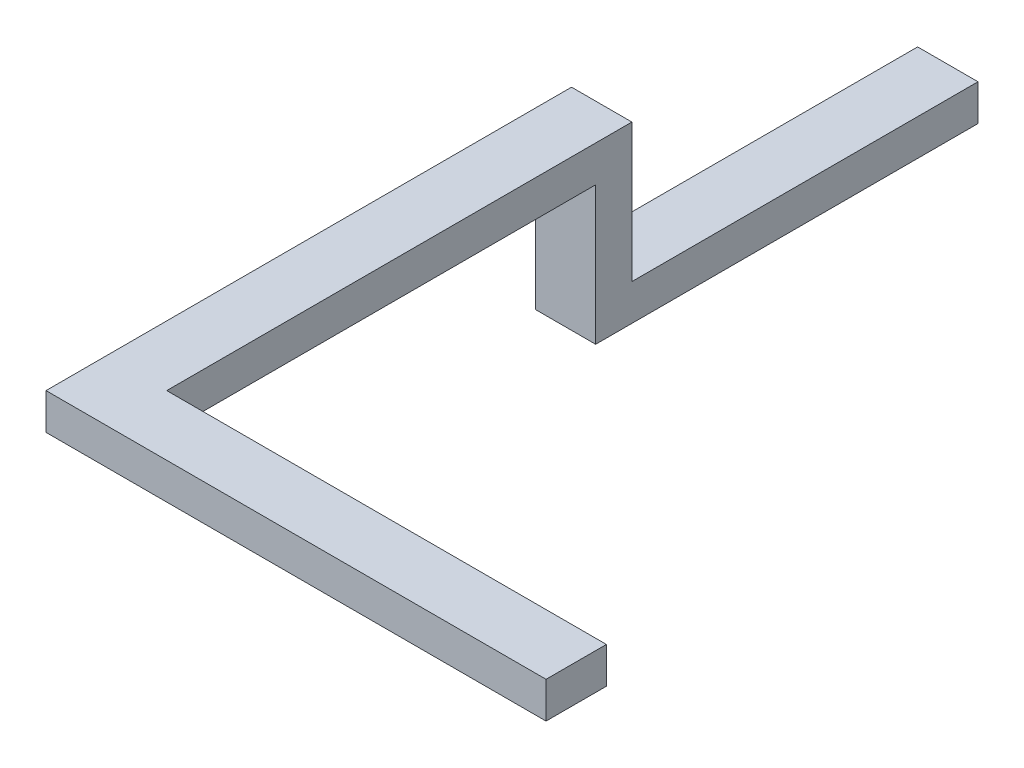
ISO-10303-21;
HEADER;
FILE_DESCRIPTION(('STEP AP214'),'2;1');
FILE_NAME('part.step','',(''),(''),'','','');
FILE_SCHEMA(('AUTOMOTIVE_DESIGN { 1 0 10303 214 1 1 1 1 }'));
ENDSEC;
DATA;
#1=APPLICATION_CONTEXT('core data for automotive mechanical design processes');
#2=APPLICATION_PROTOCOL_DEFINITION('international standard','automotive_design',2000,#1);
#3=PRODUCT_CONTEXT('',#1,'mechanical');
#4=PRODUCT('Part','Part','',(#3));
#5=PRODUCT_RELATED_PRODUCT_CATEGORY('part','',(#4));
#6=PRODUCT_DEFINITION_FORMATION('','',#4);
#7=PRODUCT_DEFINITION_CONTEXT('part definition',#1,'design');
#8=PRODUCT_DEFINITION('design','',#6,#7);
#9=PRODUCT_DEFINITION_SHAPE('','',#8);
#10=(LENGTH_UNIT() NAMED_UNIT(*) SI_UNIT(.MILLI.,.METRE.));
#11=(NAMED_UNIT(*) PLANE_ANGLE_UNIT() SI_UNIT($,.RADIAN.));
#12=(NAMED_UNIT(*) SI_UNIT($,.STERADIAN.) SOLID_ANGLE_UNIT());
#13=UNCERTAINTY_MEASURE_WITH_UNIT(LENGTH_MEASURE(1.E-05),#10,'distance_accuracy_value','');
#14=(GEOMETRIC_REPRESENTATION_CONTEXT(3) GLOBAL_UNCERTAINTY_ASSIGNED_CONTEXT((#13)) GLOBAL_UNIT_ASSIGNED_CONTEXT((#10,
#11,#12)) REPRESENTATION_CONTEXT('',''));
#15=CARTESIAN_POINT('',(0.,0.,0.));
#16=DIRECTION('',(0.,0.,1.));
#17=DIRECTION('',(1.,0.,0.));
#18=AXIS2_PLACEMENT_3D('',#15,#16,#17);
#19=CARTESIAN_POINT('',(0.,539.999999999999,6479.57134107215));
#20=DIRECTION('',(-1.,0.,0.));
#21=DIRECTION('',(0.,-1.,0.));
#22=AXIS2_PLACEMENT_3D('',#19,#20,#21);
#23=PLANE('',#22);
#24=DIRECTION('',(0.,1.,0.));
#25=VECTOR('',#24,1.);
#26=CARTESIAN_POINT('',(0.,2060.,12095.));
#27=LINE('',#26,#25);
#28=CARTESIAN_POINT('',(0.,2060.,12095.));
#29=VERTEX_POINT('',#28);
#30=CARTESIAN_POINT('',(0.,2600.,12095.));
#31=VERTEX_POINT('',#30);
#32=EDGE_CURVE('E51',#29,#31,#27,.T.);
#33=ORIENTED_EDGE('',*,*,#32,.F.);
#34=DIRECTION('',(0.,0.,1.));
#35=VECTOR('',#34,1.);
#36=CARTESIAN_POINT('',(0.,2060.,5700.));
#37=LINE('',#36,#35);
#38=CARTESIAN_POINT('',(0.,2060.,5700.));
#39=VERTEX_POINT('',#38);
#40=EDGE_CURVE('E139',#39,#29,#37,.T.);
#41=ORIENTED_EDGE('',*,*,#40,.F.);
#42=DIRECTION('',(0.,1.,0.));
#43=VECTOR('',#42,1.);
#44=CARTESIAN_POINT('',(0.,-6.99256490647889E-13,5700.));
#45=LINE('',#44,#43);
#46=CARTESIAN_POINT('',(0.,-6.99256490647889E-13,5700.));
#47=VERTEX_POINT('',#46);
#48=EDGE_CURVE('E177',#47,#39,#45,.T.);
#49=ORIENTED_EDGE('',*,*,#48,.F.);
#50=DIRECTION('',(0.,0.,-1.));
#51=VECTOR('',#50,1.);
#52=CARTESIAN_POINT('',(0.,-7.94891634536973E-13,6479.57134107215));
#53=LINE('',#52,#51);
#54=CARTESIAN_POINT('',(0.,0.,0.));
#55=VERTEX_POINT('',#54);
#56=EDGE_CURVE('E169',#47,#55,#53,.T.);
#57=ORIENTED_EDGE('',*,*,#56,.T.);
#58=DIRECTION('',(0.,1.,0.));
#59=VECTOR('',#58,1.);
#60=CARTESIAN_POINT('',(0.,540.,0.));
#61=LINE('',#60,#59);
#62=CARTESIAN_POINT('',(0.,540.,0.));
#63=VERTEX_POINT('',#62);
#64=EDGE_CURVE('E154',#55,#63,#61,.T.);
#65=ORIENTED_EDGE('',*,*,#64,.T.);
#66=DIRECTION('',(0.,0.,-1.));
#67=VECTOR('',#66,1.);
#68=CARTESIAN_POINT('',(0.,539.999999999999,6479.57134107215));
#69=LINE('',#68,#67);
#70=CARTESIAN_POINT('',(0.,540.,5160.));
#71=VERTEX_POINT('',#70);
#72=EDGE_CURVE('E167',#71,#63,#69,.T.);
#73=ORIENTED_EDGE('',*,*,#72,.F.);
#74=DIRECTION('',(0.,1.,0.));
#75=VECTOR('',#74,1.);
#76=CARTESIAN_POINT('',(0.,540.,5160.));
#77=LINE('',#76,#75);
#78=CARTESIAN_POINT('',(0.,2600.,5160.));
#79=VERTEX_POINT('',#78);
#80=EDGE_CURVE('E174',#71,#79,#77,.T.);
#81=ORIENTED_EDGE('',*,*,#80,.T.);
#82=DIRECTION('',(0.,0.,1.));
#83=VECTOR('',#82,1.);
#84=CARTESIAN_POINT('',(0.,2600.,5160.));
#85=LINE('',#84,#83);
#86=EDGE_CURVE('E190',#79,#31,#85,.T.);
#87=ORIENTED_EDGE('',*,*,#86,.T.);
#88=EDGE_LOOP('',(#33,#41,#49,#57,#65,#73,#81,#87));
#89=FACE_BOUND('',#88,.T.);
#90=ADVANCED_FACE('F34',(#89),#23,.F.);
#91=CARTESIAN_POINT('',(-900.000000000001,2600.,5160.));
#92=DIRECTION('',(0.,-1.,0.));
#93=DIRECTION('',(1.,0.,0.));
#94=AXIS2_PLACEMENT_3D('',#91,#92,#93);
#95=PLANE('',#94);
#96=DIRECTION('',(-1.,0.,0.));
#97=VECTOR('',#96,1.);
#98=CARTESIAN_POINT('',(-900.000000000001,2600.,12995.));
#99=LINE('',#98,#97);
#100=CARTESIAN_POINT('',(6555.,2600.,12995.));
#101=VERTEX_POINT('',#100);
#102=CARTESIAN_POINT('',(-900.,2600.,12995.));
#103=VERTEX_POINT('',#102);
#104=EDGE_CURVE('E59',#101,#103,#99,.T.);
#105=ORIENTED_EDGE('',*,*,#104,.F.);
#106=DIRECTION('',(0.,0.,1.));
#107=VECTOR('',#106,1.);
#108=CARTESIAN_POINT('',(6555.,2600.,12995.));
#109=LINE('',#108,#107);
#110=CARTESIAN_POINT('',(6555.,2600.,12095.));
#111=VERTEX_POINT('',#110);
#112=EDGE_CURVE('E127',#111,#101,#109,.T.);
#113=ORIENTED_EDGE('',*,*,#112,.F.);
#114=DIRECTION('',(-1.,0.,0.));
#115=VECTOR('',#114,1.);
#116=CARTESIAN_POINT('',(6555.,2600.,12095.));
#117=LINE('',#116,#115);
#118=EDGE_CURVE('E133',#111,#31,#117,.T.);
#119=ORIENTED_EDGE('',*,*,#118,.T.);
#120=ORIENTED_EDGE('',*,*,#86,.F.);
#121=DIRECTION('',(1.,0.,0.));
#122=VECTOR('',#121,1.);
#123=CARTESIAN_POINT('',(-900.000000000001,2600.,5160.));
#124=LINE('',#123,#122);
#125=CARTESIAN_POINT('',(-900.,2600.,5160.));
#126=VERTEX_POINT('',#125);
#127=EDGE_CURVE('E186',#126,#79,#124,.T.);
#128=ORIENTED_EDGE('',*,*,#127,.F.);
#129=DIRECTION('',(0.,0.,1.));
#130=VECTOR('',#129,1.);
#131=CARTESIAN_POINT('',(-900.,2600.,5160.));
#132=LINE('',#131,#130);
#133=EDGE_CURVE('E187',#126,#103,#132,.T.);
#134=ORIENTED_EDGE('',*,*,#133,.T.);
#135=EDGE_LOOP('',(#105,#113,#119,#120,#128,#134));
#136=FACE_BOUND('',#135,.T.);
#137=ADVANCED_FACE('F234',(#136),#95,.F.);
#138=CARTESIAN_POINT('',(-900.,2060.,5700.));
#139=DIRECTION('',(0.,1.,0.));
#140=DIRECTION('',(0.,0.,1.));
#141=AXIS2_PLACEMENT_3D('',#138,#139,#140);
#142=PLANE('',#141);
#143=DIRECTION('',(1.,0.,0.));
#144=VECTOR('',#143,1.);
#145=CARTESIAN_POINT('',(-900.,2060.,12995.));
#146=LINE('',#145,#144);
#147=CARTESIAN_POINT('',(-900.,2060.,12995.));
#148=VERTEX_POINT('',#147);
#149=CARTESIAN_POINT('',(6555.,2060.,12995.));
#150=VERTEX_POINT('',#149);
#151=EDGE_CURVE('E12',#148,#150,#146,.T.);
#152=ORIENTED_EDGE('',*,*,#151,.F.);
#153=DIRECTION('',(0.,0.,1.));
#154=VECTOR('',#153,1.);
#155=CARTESIAN_POINT('',(-900.,2060.,5700.));
#156=LINE('',#155,#154);
#157=CARTESIAN_POINT('',(-900.,2060.,5700.));
#158=VERTEX_POINT('',#157);
#159=EDGE_CURVE('E195',#158,#148,#156,.T.);
#160=ORIENTED_EDGE('',*,*,#159,.F.);
#161=DIRECTION('',(-1.,0.,0.));
#162=VECTOR('',#161,1.);
#163=CARTESIAN_POINT('',(-900.,2060.,5700.));
#164=LINE('',#163,#162);
#165=EDGE_CURVE('E191',#39,#158,#164,.T.);
#166=ORIENTED_EDGE('',*,*,#165,.F.);
#167=ORIENTED_EDGE('',*,*,#40,.T.);
#168=DIRECTION('',(-1.,0.,0.));
#169=VECTOR('',#168,1.);
#170=CARTESIAN_POINT('',(6555.,2060.,12095.));
#171=LINE('',#170,#169);
#172=CARTESIAN_POINT('',(6555.,2060.,12095.));
#173=VERTEX_POINT('',#172);
#174=EDGE_CURVE('E119',#173,#29,#171,.T.);
#175=ORIENTED_EDGE('',*,*,#174,.F.);
#176=DIRECTION('',(0.,0.,-1.));
#177=VECTOR('',#176,1.);
#178=CARTESIAN_POINT('',(6555.,2060.,12995.));
#179=LINE('',#178,#177);
#180=EDGE_CURVE('E117',#150,#173,#179,.T.);
#181=ORIENTED_EDGE('',*,*,#180,.F.);
#182=EDGE_LOOP('',(#152,#160,#166,#167,#175,#181));
#183=FACE_BOUND('',#182,.T.);
#184=ADVANCED_FACE('F36',(#183),#142,.F.);
#185=CARTESIAN_POINT('',(-900.,539.999999999999,5160.));
#186=DIRECTION('',(0.,0.,-1.));
#187=DIRECTION('',(-1.,0.,0.));
#188=AXIS2_PLACEMENT_3D('',#185,#186,#187);
#189=PLANE('',#188);
#190=DIRECTION('',(0.,1.,0.));
#191=VECTOR('',#190,1.);
#192=CARTESIAN_POINT('',(-900.,539.999999999999,5160.));
#193=LINE('',#192,#191);
#194=CARTESIAN_POINT('',(-900.,539.999999999999,5160.));
#195=VERTEX_POINT('',#194);
#196=EDGE_CURVE('E183',#195,#126,#193,.T.);
#197=ORIENTED_EDGE('',*,*,#196,.T.);
#198=ORIENTED_EDGE('',*,*,#127,.T.);
#199=ORIENTED_EDGE('',*,*,#80,.F.);
#200=DIRECTION('',(-1.,0.,0.));
#201=VECTOR('',#200,1.);
#202=CARTESIAN_POINT('',(-900.,539.999999999999,5160.));
#203=LINE('',#202,#201);
#204=EDGE_CURVE('E157',#71,#195,#203,.T.);
#205=ORIENTED_EDGE('',*,*,#204,.T.);
#206=EDGE_LOOP('',(#197,#198,#199,#205));
#207=FACE_BOUND('',#206,.T.);
#208=ADVANCED_FACE('F218',(#207),#189,.T.);
#209=CARTESIAN_POINT('',(-900.,-6.99256490647889E-13,5700.));
#210=DIRECTION('',(0.,0.,1.));
#211=DIRECTION('',(1.,0.,0.));
#212=AXIS2_PLACEMENT_3D('',#209,#210,#211);
#213=PLANE('',#212);
#214=ORIENTED_EDGE('',*,*,#48,.T.);
#215=ORIENTED_EDGE('',*,*,#165,.T.);
#216=DIRECTION('',(0.,1.,0.));
#217=VECTOR('',#216,1.);
#218=CARTESIAN_POINT('',(-900.,-7.91033905045424E-13,5700.));
#219=LINE('',#218,#217);
#220=CARTESIAN_POINT('',(-900.,-7.91033905045424E-13,5700.));
#221=VERTEX_POINT('',#220);
#222=EDGE_CURVE('E180',#221,#158,#219,.T.);
#223=ORIENTED_EDGE('',*,*,#222,.F.);
#224=DIRECTION('',(1.,0.,0.));
#225=VECTOR('',#224,1.);
#226=CARTESIAN_POINT('',(-900.,-6.99256490647889E-13,5700.));
#227=LINE('',#226,#225);
#228=EDGE_CURVE('E173',#221,#47,#227,.T.);
#229=ORIENTED_EDGE('',*,*,#228,.T.);
#230=EDGE_LOOP('',(#214,#215,#223,#229));
#231=FACE_BOUND('',#230,.T.);
#232=ADVANCED_FACE('F202',(#231),#213,.T.);
#233=CARTESIAN_POINT('',(-900.,539.999999999999,6479.57134107215));
#234=DIRECTION('',(0.,-1.,0.));
#235=DIRECTION('',(1.,0.,0.));
#236=AXIS2_PLACEMENT_3D('',#233,#234,#235);
#237=PLANE('',#236);
#238=ORIENTED_EDGE('',*,*,#204,.F.);
#239=ORIENTED_EDGE('',*,*,#72,.T.);
#240=DIRECTION('',(-1.,0.,0.));
#241=VECTOR('',#240,1.);
#242=CARTESIAN_POINT('',(-900.,540.,0.));
#243=LINE('',#242,#241);
#244=CARTESIAN_POINT('',(-900.,540.,0.));
#245=VERTEX_POINT('',#244);
#246=EDGE_CURVE('E162',#63,#245,#243,.T.);
#247=ORIENTED_EDGE('',*,*,#246,.T.);
#248=DIRECTION('',(0.,0.,-1.));
#249=VECTOR('',#248,1.);
#250=CARTESIAN_POINT('',(-900.,539.999999999999,6479.57134107215));
#251=LINE('',#250,#249);
#252=EDGE_CURVE('E165',#195,#245,#251,.T.);
#253=ORIENTED_EDGE('',*,*,#252,.F.);
#254=EDGE_LOOP('',(#238,#239,#247,#253));
#255=FACE_BOUND('',#254,.T.);
#256=ADVANCED_FACE('F214',(#255),#237,.F.);
#257=CARTESIAN_POINT('',(-900.,-7.94891634536973E-13,6479.57134107215));
#258=DIRECTION('',(0.,1.,0.));
#259=DIRECTION('',(0.,0.,1.));
#260=AXIS2_PLACEMENT_3D('',#257,#258,#259);
#261=PLANE('',#260);
#262=ORIENTED_EDGE('',*,*,#228,.F.);
#263=DIRECTION('',(0.,0.,-1.));
#264=VECTOR('',#263,1.);
#265=CARTESIAN_POINT('',(-900.,-7.94891634536973E-13,6479.57134107215));
#266=LINE('',#265,#264);
#267=CARTESIAN_POINT('',(-900.,0.,0.));
#268=VERTEX_POINT('',#267);
#269=EDGE_CURVE('E171',#221,#268,#266,.T.);
#270=ORIENTED_EDGE('',*,*,#269,.T.);
#271=DIRECTION('',(1.,0.,0.));
#272=VECTOR('',#271,1.);
#273=CARTESIAN_POINT('',(-900.,0.,0.));
#274=LINE('',#273,#272);
#275=EDGE_CURVE('E148',#268,#55,#274,.T.);
#276=ORIENTED_EDGE('',*,*,#275,.T.);
#277=ORIENTED_EDGE('',*,*,#56,.F.);
#278=EDGE_LOOP('',(#262,#270,#276,#277));
#279=FACE_BOUND('',#278,.T.);
#280=ADVANCED_FACE('F204',(#279),#261,.F.);
#281=CARTESIAN_POINT('',(-900.,539.999999999999,6479.57134107215));
#282=DIRECTION('',(1.,0.,0.));
#283=DIRECTION('',(0.,0.,-1.));
#284=AXIS2_PLACEMENT_3D('',#281,#282,#283);
#285=PLANE('',#284);
#286=ORIENTED_EDGE('',*,*,#269,.F.);
#287=ORIENTED_EDGE('',*,*,#222,.T.);
#288=ORIENTED_EDGE('',*,*,#159,.T.);
#289=DIRECTION('',(0.,-1.,0.));
#290=VECTOR('',#289,1.);
#291=CARTESIAN_POINT('',(-900.,910.214329463921,12995.));
#292=LINE('',#291,#290);
#293=EDGE_CURVE('E43',#103,#148,#292,.T.);
#294=ORIENTED_EDGE('',*,*,#293,.F.);
#295=ORIENTED_EDGE('',*,*,#133,.F.);
#296=ORIENTED_EDGE('',*,*,#196,.F.);
#297=ORIENTED_EDGE('',*,*,#252,.T.);
#298=DIRECTION('',(0.,-1.,0.));
#299=VECTOR('',#298,1.);
#300=CARTESIAN_POINT('',(-900.,540.,0.));
#301=LINE('',#300,#299);
#302=EDGE_CURVE('E145',#245,#268,#301,.T.);
#303=ORIENTED_EDGE('',*,*,#302,.T.);
#304=EDGE_LOOP('',(#286,#287,#288,#294,#295,#296,#297,#303));
#305=FACE_BOUND('',#304,.T.);
#306=ADVANCED_FACE('F223',(#305),#285,.F.);
#307=CARTESIAN_POINT('',(0.,0.,0.));
#308=DIRECTION('',(0.,0.,1.));
#309=DIRECTION('',(1.,0.,0.));
#310=AXIS2_PLACEMENT_3D('',#307,#308,#309);
#311=PLANE('',#310);
#312=ORIENTED_EDGE('',*,*,#302,.F.);
#313=ORIENTED_EDGE('',*,*,#246,.F.);
#314=ORIENTED_EDGE('',*,*,#64,.F.);
#315=ORIENTED_EDGE('',*,*,#275,.F.);
#316=EDGE_LOOP('',(#312,#313,#314,#315));
#317=FACE_BOUND('',#316,.T.);
#318=ADVANCED_FACE('F209',(#317),#311,.F.);
#319=CARTESIAN_POINT('',(-450.,2330.,12995.));
#320=DIRECTION('',(0.,0.,1.));
#321=DIRECTION('',(0.,-1.,0.));
#322=AXIS2_PLACEMENT_3D('',#319,#320,#321);
#323=PLANE('',#322);
#324=ORIENTED_EDGE('',*,*,#293,.T.);
#325=ORIENTED_EDGE('',*,*,#151,.T.);
#326=DIRECTION('',(0.,-1.,0.));
#327=VECTOR('',#326,1.);
#328=CARTESIAN_POINT('',(6555.,2060.,12995.));
#329=LINE('',#328,#327);
#330=EDGE_CURVE('E113',#101,#150,#329,.T.);
#331=ORIENTED_EDGE('',*,*,#330,.F.);
#332=ORIENTED_EDGE('',*,*,#104,.T.);
#333=EDGE_LOOP('',(#324,#325,#331,#332));
#334=FACE_BOUND('',#333,.T.);
#335=ADVANCED_FACE('F111',(#334),#323,.T.);
#336=CARTESIAN_POINT('',(6555.,2060.,12095.));
#337=DIRECTION('',(0.,0.,1.));
#338=DIRECTION('',(1.,0.,0.));
#339=AXIS2_PLACEMENT_3D('',#336,#337,#338);
#340=PLANE('',#339);
#341=ORIENTED_EDGE('',*,*,#32,.T.);
#342=ORIENTED_EDGE('',*,*,#118,.F.);
#343=DIRECTION('',(0.,1.,0.));
#344=VECTOR('',#343,1.);
#345=CARTESIAN_POINT('',(6555.,2060.,12095.));
#346=LINE('',#345,#344);
#347=EDGE_CURVE('E122',#173,#111,#346,.T.);
#348=ORIENTED_EDGE('',*,*,#347,.F.);
#349=ORIENTED_EDGE('',*,*,#174,.T.);
#350=EDGE_LOOP('',(#341,#342,#348,#349));
#351=FACE_BOUND('',#350,.T.);
#352=ADVANCED_FACE('F244',(#351),#340,.F.);
#353=CARTESIAN_POINT('',(6555.,0.,0.));
#354=DIRECTION('',(-1.,0.,0.));
#355=DIRECTION('',(0.,-1.,0.));
#356=AXIS2_PLACEMENT_3D('',#353,#354,#355);
#357=PLANE('',#356);
#358=ORIENTED_EDGE('',*,*,#330,.T.);
#359=ORIENTED_EDGE('',*,*,#180,.T.);
#360=ORIENTED_EDGE('',*,*,#347,.T.);
#361=ORIENTED_EDGE('',*,*,#112,.T.);
#362=EDGE_LOOP('',(#358,#359,#360,#361));
#363=FACE_BOUND('',#362,.T.);
#364=ADVANCED_FACE('F125',(#363),#357,.F.);
#365=CLOSED_SHELL('',(#90,#137,#184,#208,#232,#256,#280,#306,#318,#335,#352,#364));
#366=MANIFOLD_SOLID_BREP('B2',#365);
#367=ADVANCED_BREP_SHAPE_REPRESENTATION('',(#18,#366),#14);
#368=SHAPE_DEFINITION_REPRESENTATION(#9,#367);
ENDSEC;
END-ISO-10303-21;
